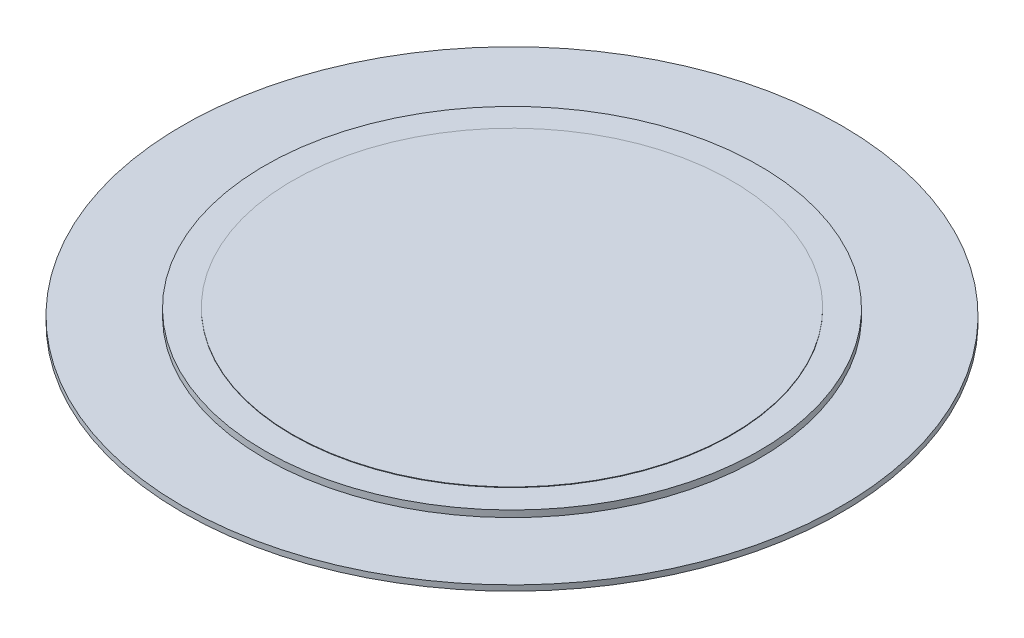
ISO-10303-21;
HEADER;
FILE_DESCRIPTION(('STEP AP214'),'2;1');
FILE_NAME('part.step','',(''),(''),'','','');
FILE_SCHEMA(('AUTOMOTIVE_DESIGN { 1 0 10303 214 1 1 1 1 }'));
ENDSEC;
DATA;
#1=APPLICATION_CONTEXT('core data for automotive mechanical design processes');
#2=APPLICATION_PROTOCOL_DEFINITION('international standard','automotive_design',2000,#1);
#3=PRODUCT_CONTEXT('',#1,'mechanical');
#4=PRODUCT('Part','Part','',(#3));
#5=PRODUCT_RELATED_PRODUCT_CATEGORY('part','',(#4));
#6=PRODUCT_DEFINITION_FORMATION('','',#4);
#7=PRODUCT_DEFINITION_CONTEXT('part definition',#1,'design');
#8=PRODUCT_DEFINITION('design','',#6,#7);
#9=PRODUCT_DEFINITION_SHAPE('','',#8);
#10=(LENGTH_UNIT() NAMED_UNIT(*) SI_UNIT(.MILLI.,.METRE.));
#11=(NAMED_UNIT(*) PLANE_ANGLE_UNIT() SI_UNIT($,.RADIAN.));
#12=(NAMED_UNIT(*) SI_UNIT($,.STERADIAN.) SOLID_ANGLE_UNIT());
#13=UNCERTAINTY_MEASURE_WITH_UNIT(LENGTH_MEASURE(1.E-05),#10,'distance_accuracy_value','');
#14=(GEOMETRIC_REPRESENTATION_CONTEXT(3) GLOBAL_UNCERTAINTY_ASSIGNED_CONTEXT((#13)) GLOBAL_UNIT_ASSIGNED_CONTEXT((#10,
#11,#12)) REPRESENTATION_CONTEXT('',''));
#15=CARTESIAN_POINT('',(0.,0.,0.));
#16=DIRECTION('',(0.,0.,1.));
#17=DIRECTION('',(1.,0.,0.));
#18=AXIS2_PLACEMENT_3D('',#15,#16,#17);
#19=CARTESIAN_POINT('',(0.,0.1,0.));
#20=DIRECTION('',(0.,-1.,0.));
#21=DIRECTION('',(0.,0.,-1.));
#22=AXIS2_PLACEMENT_3D('',#19,#20,#21);
#23=CYLINDRICAL_SURFACE('',#22,6.);
#24=CARTESIAN_POINT('',(0.,0.1,0.));
#25=DIRECTION('',(0.,1.,0.));
#26=DIRECTION('',(0.,0.,1.));
#27=AXIS2_PLACEMENT_3D('',#24,#25,#26);
#28=CIRCLE('',#27,6.);
#29=CARTESIAN_POINT('',(0.,0.1,6.));
#30=VERTEX_POINT('',#29);
#31=EDGE_CURVE('E48',#30,#30,#28,.T.);
#32=ORIENTED_EDGE('',*,*,#31,.F.);
#33=EDGE_LOOP('',(#32));
#34=FACE_BOUND('',#33,.T.);
#35=CARTESIAN_POINT('',(0.,0.,0.));
#36=DIRECTION('',(0.,1.,0.));
#37=DIRECTION('',(0.,0.,1.));
#38=AXIS2_PLACEMENT_3D('',#35,#36,#37);
#39=CIRCLE('',#38,6.);
#40=CARTESIAN_POINT('',(0.,0.,6.));
#41=VERTEX_POINT('',#40);
#42=EDGE_CURVE('E39',#41,#41,#39,.T.);
#43=ORIENTED_EDGE('',*,*,#42,.T.);
#44=EDGE_LOOP('',(#43));
#45=FACE_BOUND('',#44,.T.);
#46=ADVANCED_FACE('F36',(#34,#45),#23,.T.);
#47=CARTESIAN_POINT('',(0.,0.1,0.));
#48=DIRECTION('',(0.,1.,0.));
#49=DIRECTION('',(0.,0.,1.));
#50=AXIS2_PLACEMENT_3D('',#47,#48,#49);
#51=PLANE('',#50);
#52=CARTESIAN_POINT('',(0.,0.1,0.));
#53=DIRECTION('',(0.,1.,0.));
#54=DIRECTION('',(0.,0.,1.));
#55=AXIS2_PLACEMENT_3D('',#52,#53,#54);
#56=CIRCLE('',#55,4.5);
#57=CARTESIAN_POINT('',(0.,0.1,4.5));
#58=VERTEX_POINT('',#57);
#59=EDGE_CURVE('E43',#58,#58,#56,.T.);
#60=ORIENTED_EDGE('',*,*,#59,.F.);
#61=EDGE_LOOP('',(#60));
#62=FACE_BOUND('',#61,.T.);
#63=ORIENTED_EDGE('',*,*,#31,.T.);
#64=EDGE_LOOP('',(#63));
#65=FACE_BOUND('',#64,.T.);
#66=ADVANCED_FACE('F65',(#62,#65),#51,.T.);
#67=CARTESIAN_POINT('',(0.,0.,0.));
#68=DIRECTION('',(0.,1.,0.));
#69=DIRECTION('',(0.,0.,1.));
#70=AXIS2_PLACEMENT_3D('',#67,#68,#69);
#71=PLANE('',#70);
#72=ORIENTED_EDGE('',*,*,#42,.F.);
#73=EDGE_LOOP('',(#72));
#74=FACE_BOUND('',#73,.T.);
#75=ADVANCED_FACE('F62',(#74),#71,.F.);
#76=CARTESIAN_POINT('',(0.,0.22,0.));
#77=DIRECTION('',(0.,-1.,0.));
#78=DIRECTION('',(0.,0.,-1.));
#79=AXIS2_PLACEMENT_3D('',#76,#77,#78);
#80=CYLINDRICAL_SURFACE('',#79,4.5);
#81=CARTESIAN_POINT('',(0.,0.22,0.));
#82=DIRECTION('',(0.,1.,0.));
#83=DIRECTION('',(0.,0.,1.));
#84=AXIS2_PLACEMENT_3D('',#81,#82,#83);
#85=CIRCLE('',#84,4.5);
#86=CARTESIAN_POINT('',(0.,0.22,4.5));
#87=VERTEX_POINT('',#86);
#88=EDGE_CURVE('E53',#87,#87,#85,.T.);
#89=ORIENTED_EDGE('',*,*,#88,.F.);
#90=EDGE_LOOP('',(#89));
#91=FACE_BOUND('',#90,.T.);
#92=ORIENTED_EDGE('',*,*,#59,.T.);
#93=EDGE_LOOP('',(#92));
#94=FACE_BOUND('',#93,.T.);
#95=ADVANCED_FACE('F64',(#91,#94),#80,.T.);
#96=CARTESIAN_POINT('',(0.,0.22,0.));
#97=DIRECTION('',(0.,1.,0.));
#98=DIRECTION('',(0.,0.,1.));
#99=AXIS2_PLACEMENT_3D('',#96,#97,#98);
#100=PLANE('',#99);
#101=CARTESIAN_POINT('',(0.,0.22,0.));
#102=DIRECTION('',(0.,1.,0.));
#103=DIRECTION('',(0.,0.,1.));
#104=AXIS2_PLACEMENT_3D('',#101,#102,#103);
#105=CIRCLE('',#104,4.);
#106=CARTESIAN_POINT('',(0.,0.22,4.));
#107=VERTEX_POINT('',#106);
#108=EDGE_CURVE('E10',#107,#107,#105,.T.);
#109=ORIENTED_EDGE('',*,*,#108,.F.);
#110=EDGE_LOOP('',(#109));
#111=FACE_BOUND('',#110,.T.);
#112=ORIENTED_EDGE('',*,*,#88,.T.);
#113=EDGE_LOOP('',(#112));
#114=FACE_BOUND('',#113,.T.);
#115=ADVANCED_FACE('F70',(#111,#114),#100,.T.);
#116=CARTESIAN_POINT('',(0.,0.23,0.));
#117=DIRECTION('',(0.,-1.,0.));
#118=DIRECTION('',(0.,0.,-1.));
#119=AXIS2_PLACEMENT_3D('',#116,#117,#118);
#120=CYLINDRICAL_SURFACE('',#119,4.);
#121=CARTESIAN_POINT('',(0.,0.23,0.));
#122=DIRECTION('',(0.,1.,0.));
#123=DIRECTION('',(0.,0.,1.));
#124=AXIS2_PLACEMENT_3D('',#121,#122,#123);
#125=CIRCLE('',#124,4.);
#126=CARTESIAN_POINT('',(0.,0.23,4.));
#127=VERTEX_POINT('',#126);
#128=EDGE_CURVE('E52',#127,#127,#125,.T.);
#129=ORIENTED_EDGE('',*,*,#128,.F.);
#130=EDGE_LOOP('',(#129));
#131=FACE_BOUND('',#130,.T.);
#132=ORIENTED_EDGE('',*,*,#108,.T.);
#133=EDGE_LOOP('',(#132));
#134=FACE_BOUND('',#133,.T.);
#135=ADVANCED_FACE('F100',(#131,#134),#120,.T.);
#136=CARTESIAN_POINT('',(0.,0.23,0.));
#137=DIRECTION('',(0.,1.,0.));
#138=DIRECTION('',(0.,0.,1.));
#139=AXIS2_PLACEMENT_3D('',#136,#137,#138);
#140=PLANE('',#139);
#141=ORIENTED_EDGE('',*,*,#128,.T.);
#142=EDGE_LOOP('',(#141));
#143=FACE_BOUND('',#142,.T.);
#144=ADVANCED_FACE('F110',(#143),#140,.T.);
#145=CLOSED_SHELL('',(#46,#66,#75,#95,#115,#135,#144));
#146=MANIFOLD_SOLID_BREP('B2',#145);
#147=ADVANCED_BREP_SHAPE_REPRESENTATION('',(#18,#146),#14);
#148=SHAPE_DEFINITION_REPRESENTATION(#9,#147);
ENDSEC;
END-ISO-10303-21;
